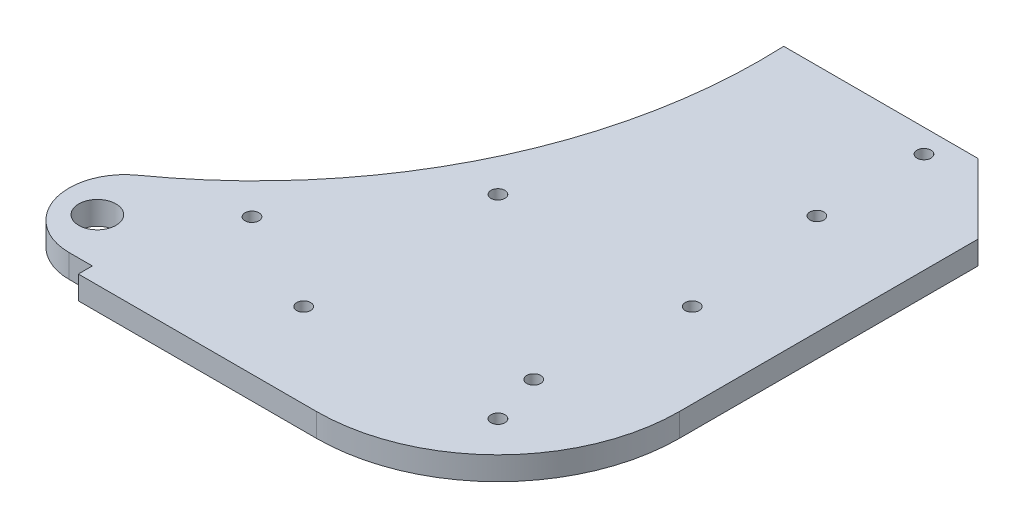
ISO-10303-21;
HEADER;
FILE_DESCRIPTION(('STEP AP214'),'2;1');
FILE_NAME('part.step','',(''),(''),'','','');
FILE_SCHEMA(('AUTOMOTIVE_DESIGN { 1 0 10303 214 1 1 1 1 }'));
ENDSEC;
DATA;
#1=APPLICATION_CONTEXT('core data for automotive mechanical design processes');
#2=APPLICATION_PROTOCOL_DEFINITION('international standard','automotive_design',2000,#1);
#3=PRODUCT_CONTEXT('',#1,'mechanical');
#4=PRODUCT('Part','Part','',(#3));
#5=PRODUCT_RELATED_PRODUCT_CATEGORY('part','',(#4));
#6=PRODUCT_DEFINITION_FORMATION('','',#4);
#7=PRODUCT_DEFINITION_CONTEXT('part definition',#1,'design');
#8=PRODUCT_DEFINITION('design','',#6,#7);
#9=PRODUCT_DEFINITION_SHAPE('','',#8);
#10=(LENGTH_UNIT() NAMED_UNIT(*) SI_UNIT(.MILLI.,.METRE.));
#11=(NAMED_UNIT(*) PLANE_ANGLE_UNIT() SI_UNIT($,.RADIAN.));
#12=(NAMED_UNIT(*) SI_UNIT($,.STERADIAN.) SOLID_ANGLE_UNIT());
#13=UNCERTAINTY_MEASURE_WITH_UNIT(LENGTH_MEASURE(1.E-05),#10,'distance_accuracy_value','');
#14=(GEOMETRIC_REPRESENTATION_CONTEXT(3) GLOBAL_UNCERTAINTY_ASSIGNED_CONTEXT((#13)) GLOBAL_UNIT_ASSIGNED_CONTEXT((#10,
#11,#12)) REPRESENTATION_CONTEXT('',''));
#15=CARTESIAN_POINT('',(0.,0.,0.));
#16=DIRECTION('',(0.,0.,1.));
#17=DIRECTION('',(1.,0.,0.));
#18=AXIS2_PLACEMENT_3D('',#15,#16,#17);
#19=CARTESIAN_POINT('',(0.,5.,0.));
#20=DIRECTION('',(0.,-1.,0.));
#21=DIRECTION('',(0.,0.,-1.));
#22=AXIS2_PLACEMENT_3D('',#19,#20,#21);
#23=CYLINDRICAL_SURFACE('',#22,38.9999999999999);
#24=CARTESIAN_POINT('',(0.,0.,0.));
#25=DIRECTION('',(0.,1.,0.));
#26=DIRECTION('',(0.,0.,1.));
#27=AXIS2_PLACEMENT_3D('',#24,#25,#26);
#28=CIRCLE('',#27,38.9999999999999);
#29=CARTESIAN_POINT('',(0.,0.,38.9999999999999));
#30=VERTEX_POINT('',#29);
#31=CARTESIAN_POINT('',(38.9999999999999,0.,0.));
#32=VERTEX_POINT('',#31);
#33=EDGE_CURVE('E134',#30,#32,#28,.T.);
#34=ORIENTED_EDGE('',*,*,#33,.T.);
#35=DIRECTION('',(0.,-1.,0.));
#36=VECTOR('',#35,1.);
#37=CARTESIAN_POINT('',(38.9999999999999,5.,0.));
#38=LINE('',#37,#36);
#39=CARTESIAN_POINT('',(38.9999999999999,5.,0.));
#40=VERTEX_POINT('',#39);
#41=EDGE_CURVE('E11',#40,#32,#38,.T.);
#42=ORIENTED_EDGE('',*,*,#41,.F.);
#43=CARTESIAN_POINT('',(0.,5.,0.));
#44=DIRECTION('',(0.,1.,0.));
#45=DIRECTION('',(0.,0.,1.));
#46=AXIS2_PLACEMENT_3D('',#43,#44,#45);
#47=CIRCLE('',#46,38.9999999999999);
#48=CARTESIAN_POINT('',(0.,5.,38.9999999999999));
#49=VERTEX_POINT('',#48);
#50=EDGE_CURVE('E151',#49,#40,#47,.T.);
#51=ORIENTED_EDGE('',*,*,#50,.F.);
#52=DIRECTION('',(0.,-1.,0.));
#53=VECTOR('',#52,1.);
#54=CARTESIAN_POINT('',(0.,5.,38.9999999999999));
#55=LINE('',#54,#53);
#56=EDGE_CURVE('E130',#49,#30,#55,.T.);
#57=ORIENTED_EDGE('',*,*,#56,.T.);
#58=EDGE_LOOP('',(#34,#42,#51,#57));
#59=FACE_BOUND('',#58,.T.);
#60=ADVANCED_FACE('F32',(#59),#23,.T.);
#61=CARTESIAN_POINT('',(38.9999999999999,5.,0.));
#62=DIRECTION('',(-1.,0.,0.));
#63=DIRECTION('',(0.,0.,1.));
#64=AXIS2_PLACEMENT_3D('',#61,#62,#63);
#65=PLANE('',#64);
#66=DIRECTION('',(0.,0.,-1.));
#67=VECTOR('',#66,1.);
#68=CARTESIAN_POINT('',(38.9999999999999,0.,0.));
#69=LINE('',#68,#67);
#70=CARTESIAN_POINT('',(38.9999999999999,0.,-64.082873122681));
#71=VERTEX_POINT('',#70);
#72=EDGE_CURVE('E137',#32,#71,#69,.T.);
#73=ORIENTED_EDGE('',*,*,#72,.T.);
#74=DIRECTION('',(0.,-1.,0.));
#75=VECTOR('',#74,1.);
#76=CARTESIAN_POINT('',(38.9999999999999,5.,-64.082873122681));
#77=LINE('',#76,#75);
#78=CARTESIAN_POINT('',(38.9999999999999,5.,-64.082873122681));
#79=VERTEX_POINT('',#78);
#80=EDGE_CURVE('E40',#79,#71,#77,.T.);
#81=ORIENTED_EDGE('',*,*,#80,.F.);
#82=DIRECTION('',(0.,0.,-1.));
#83=VECTOR('',#82,1.);
#84=CARTESIAN_POINT('',(38.9999999999999,5.,0.));
#85=LINE('',#84,#83);
#86=EDGE_CURVE('E94',#40,#79,#85,.T.);
#87=ORIENTED_EDGE('',*,*,#86,.F.);
#88=ORIENTED_EDGE('',*,*,#41,.T.);
#89=EDGE_LOOP('',(#73,#81,#87,#88));
#90=FACE_BOUND('',#89,.T.);
#91=ADVANCED_FACE('F288',(#90),#65,.F.);
#92=CARTESIAN_POINT('',(23.9999999999999,5.,-79.082873122681));
#93=DIRECTION('',(-0.707106781186548,0.,0.707106781186548));
#94=DIRECTION('',(0.707106781186548,0.,0.707106781186548));
#95=AXIS2_PLACEMENT_3D('',#92,#93,#94);
#96=PLANE('',#95);
#97=DIRECTION('',(-0.707106781186547,0.,-0.707106781186547));
#98=VECTOR('',#97,1.);
#99=CARTESIAN_POINT('',(23.9999999999999,0.,-79.082873122681));
#100=LINE('',#99,#98);
#101=CARTESIAN_POINT('',(23.9999999999999,0.,-79.082873122681));
#102=VERTEX_POINT('',#101);
#103=EDGE_CURVE('E140',#71,#102,#100,.T.);
#104=ORIENTED_EDGE('',*,*,#103,.T.);
#105=DIRECTION('',(0.,-1.,0.));
#106=VECTOR('',#105,1.);
#107=CARTESIAN_POINT('',(23.9999999999999,5.,-79.082873122681));
#108=LINE('',#107,#106);
#109=CARTESIAN_POINT('',(23.9999999999999,5.,-79.082873122681));
#110=VERTEX_POINT('',#109);
#111=EDGE_CURVE('E161',#110,#102,#108,.T.);
#112=ORIENTED_EDGE('',*,*,#111,.F.);
#113=DIRECTION('',(-0.707106781186547,0.,-0.707106781186547));
#114=VECTOR('',#113,1.);
#115=CARTESIAN_POINT('',(23.9999999999999,5.,-79.082873122681));
#116=LINE('',#115,#114);
#117=EDGE_CURVE('E169',#79,#110,#116,.T.);
#118=ORIENTED_EDGE('',*,*,#117,.F.);
#119=ORIENTED_EDGE('',*,*,#80,.T.);
#120=EDGE_LOOP('',(#104,#112,#118,#119));
#121=FACE_BOUND('',#120,.T.);
#122=ADVANCED_FACE('F167',(#121),#96,.F.);
#123=CARTESIAN_POINT('',(-17.7152686029994,5.,-79.082873122681));
#124=DIRECTION('',(0.,0.,1.));
#125=DIRECTION('',(1.,0.,0.));
#126=AXIS2_PLACEMENT_3D('',#123,#124,#125);
#127=PLANE('',#126);
#128=DIRECTION('',(-1.,0.,0.));
#129=VECTOR('',#128,1.);
#130=CARTESIAN_POINT('',(-17.7152686029994,0.,-79.082873122681));
#131=LINE('',#130,#129);
#132=CARTESIAN_POINT('',(-17.7152686029994,0.,-79.082873122681));
#133=VERTEX_POINT('',#132);
#134=EDGE_CURVE('E142',#102,#133,#131,.T.);
#135=ORIENTED_EDGE('',*,*,#134,.T.);
#136=DIRECTION('',(0.,-1.,0.));
#137=VECTOR('',#136,1.);
#138=CARTESIAN_POINT('',(-17.7152686029994,5.,-79.082873122681));
#139=LINE('',#138,#137);
#140=CARTESIAN_POINT('',(-17.7152686029994,5.,-79.082873122681));
#141=VERTEX_POINT('',#140);
#142=EDGE_CURVE('E158',#141,#133,#139,.T.);
#143=ORIENTED_EDGE('',*,*,#142,.F.);
#144=DIRECTION('',(-1.,0.,0.));
#145=VECTOR('',#144,1.);
#146=CARTESIAN_POINT('',(-17.7152686029994,5.,-79.082873122681));
#147=LINE('',#146,#145);
#148=EDGE_CURVE('E185',#110,#141,#147,.T.);
#149=ORIENTED_EDGE('',*,*,#148,.F.);
#150=ORIENTED_EDGE('',*,*,#111,.T.);
#151=EDGE_LOOP('',(#135,#143,#149,#150));
#152=FACE_BOUND('',#151,.T.);
#153=ADVANCED_FACE('F178',(#152),#127,.F.);
#154=CARTESIAN_POINT('',(-126.1,5.,-74.0828731226806));
#155=DIRECTION('',(0.,-1.,0.));
#156=DIRECTION('',(0.,0.,-1.));
#157=AXIS2_PLACEMENT_3D('',#154,#155,#156);
#158=CYLINDRICAL_SURFACE('',#157,108.5);
#159=CARTESIAN_POINT('',(-126.1,0.,-74.0828731226806));
#160=DIRECTION('',(0.,-1.,0.));
#161=DIRECTION('',(0.,0.,1.));
#162=AXIS2_PLACEMENT_3D('',#159,#160,#161);
#163=CIRCLE('',#162,108.5);
#164=CARTESIAN_POINT('',(-63.0709543568465,0.,14.2324109753353));
#165=VERTEX_POINT('',#164);
#166=EDGE_CURVE('E144',#133,#165,#163,.T.);
#167=ORIENTED_EDGE('',*,*,#166,.T.);
#168=DIRECTION('',(0.,-1.,0.));
#169=VECTOR('',#168,1.);
#170=CARTESIAN_POINT('',(-63.0709543568465,5.,14.2324109753353));
#171=LINE('',#170,#169);
#172=CARTESIAN_POINT('',(-63.0709543568465,5.,14.2324109753353));
#173=VERTEX_POINT('',#172);
#174=EDGE_CURVE('E155',#173,#165,#171,.T.);
#175=ORIENTED_EDGE('',*,*,#174,.F.);
#176=CARTESIAN_POINT('',(-126.1,5.,-74.0828731226806));
#177=DIRECTION('',(0.,-1.,0.));
#178=DIRECTION('',(0.,0.,1.));
#179=AXIS2_PLACEMENT_3D('',#176,#177,#178);
#180=CIRCLE('',#179,108.5);
#181=EDGE_CURVE('E184',#141,#173,#180,.T.);
#182=ORIENTED_EDGE('',*,*,#181,.F.);
#183=ORIENTED_EDGE('',*,*,#142,.T.);
#184=EDGE_LOOP('',(#167,#175,#182,#183));
#185=FACE_BOUND('',#184,.T.);
#186=ADVANCED_FACE('F182',(#185),#158,.F.);
#187=CARTESIAN_POINT('',(-56.1000000000001,5.,24.0000000000006));
#188=DIRECTION('',(0.,-1.,0.));
#189=DIRECTION('',(0.,0.,-1.));
#190=AXIS2_PLACEMENT_3D('',#187,#188,#189);
#191=CYLINDRICAL_SURFACE('',#190,12.);
#192=CARTESIAN_POINT('',(-56.1000000000001,0.,24.0000000000006));
#193=DIRECTION('',(0.,1.,0.));
#194=DIRECTION('',(0.,0.,1.));
#195=AXIS2_PLACEMENT_3D('',#192,#193,#194);
#196=CIRCLE('',#195,12.);
#197=CARTESIAN_POINT('',(-56.1000000000001,0.,36.0000000000006));
#198=VERTEX_POINT('',#197);
#199=EDGE_CURVE('E146',#165,#198,#196,.T.);
#200=ORIENTED_EDGE('',*,*,#199,.T.);
#201=DIRECTION('',(0.,-1.,0.));
#202=VECTOR('',#201,1.);
#203=CARTESIAN_POINT('',(-56.1000000000001,5.,36.0000000000006));
#204=LINE('',#203,#202);
#205=CARTESIAN_POINT('',(-56.1000000000001,5.,36.0000000000006));
#206=VERTEX_POINT('',#205);
#207=EDGE_CURVE('E125',#206,#198,#204,.T.);
#208=ORIENTED_EDGE('',*,*,#207,.F.);
#209=CARTESIAN_POINT('',(-56.1000000000001,5.,24.0000000000006));
#210=DIRECTION('',(0.,1.,0.));
#211=DIRECTION('',(0.,0.,1.));
#212=AXIS2_PLACEMENT_3D('',#209,#210,#211);
#213=CIRCLE('',#212,12.);
#214=EDGE_CURVE('E116',#173,#206,#213,.T.);
#215=ORIENTED_EDGE('',*,*,#214,.F.);
#216=ORIENTED_EDGE('',*,*,#174,.T.);
#217=EDGE_LOOP('',(#200,#208,#215,#216));
#218=FACE_BOUND('',#217,.T.);
#219=ADVANCED_FACE('F296',(#218),#191,.T.);
#220=CARTESIAN_POINT('',(-56.1000000000001,5.,36.0000000000006));
#221=DIRECTION('',(0.,0.,-1.));
#222=DIRECTION('',(-1.,0.,0.));
#223=AXIS2_PLACEMENT_3D('',#220,#221,#222);
#224=PLANE('',#223);
#225=DIRECTION('',(1.,0.,0.));
#226=VECTOR('',#225,1.);
#227=CARTESIAN_POINT('',(-56.1000000000001,0.,36.0000000000006));
#228=LINE('',#227,#226);
#229=CARTESIAN_POINT('',(-51.1000000000001,0.,36.0000000000006));
#230=VERTEX_POINT('',#229);
#231=EDGE_CURVE('E124',#198,#230,#228,.T.);
#232=ORIENTED_EDGE('',*,*,#231,.T.);
#233=DIRECTION('',(0.,-1.,0.));
#234=VECTOR('',#233,1.);
#235=CARTESIAN_POINT('',(-51.1000000000001,5.,36.0000000000006));
#236=LINE('',#235,#234);
#237=CARTESIAN_POINT('',(-51.1000000000001,5.,36.0000000000006));
#238=VERTEX_POINT('',#237);
#239=EDGE_CURVE('E121',#238,#230,#236,.T.);
#240=ORIENTED_EDGE('',*,*,#239,.F.);
#241=DIRECTION('',(1.,0.,0.));
#242=VECTOR('',#241,1.);
#243=CARTESIAN_POINT('',(-56.1000000000001,5.,36.0000000000006));
#244=LINE('',#243,#242);
#245=EDGE_CURVE('E110',#206,#238,#244,.T.);
#246=ORIENTED_EDGE('',*,*,#245,.F.);
#247=ORIENTED_EDGE('',*,*,#207,.T.);
#248=EDGE_LOOP('',(#232,#240,#246,#247));
#249=FACE_BOUND('',#248,.T.);
#250=ADVANCED_FACE('F122',(#249),#224,.F.);
#251=CARTESIAN_POINT('',(-51.1000000000001,5.,36.0000000000006));
#252=DIRECTION('',(1.,0.,0.));
#253=DIRECTION('',(0.,0.,-1.));
#254=AXIS2_PLACEMENT_3D('',#251,#252,#253);
#255=PLANE('',#254);
#256=DIRECTION('',(0.,0.,1.));
#257=VECTOR('',#256,1.);
#258=CARTESIAN_POINT('',(-51.1000000000001,0.,36.0000000000006));
#259=LINE('',#258,#257);
#260=CARTESIAN_POINT('',(-51.1000000000001,0.,39.0000000000006));
#261=VERTEX_POINT('',#260);
#262=EDGE_CURVE('E80',#230,#261,#259,.T.);
#263=ORIENTED_EDGE('',*,*,#262,.T.);
#264=DIRECTION('',(0.,-1.,0.));
#265=VECTOR('',#264,1.);
#266=CARTESIAN_POINT('',(-51.1000000000001,5.,39.0000000000006));
#267=LINE('',#266,#265);
#268=CARTESIAN_POINT('',(-51.1000000000001,5.,39.0000000000006));
#269=VERTEX_POINT('',#268);
#270=EDGE_CURVE('E126',#269,#261,#267,.T.);
#271=ORIENTED_EDGE('',*,*,#270,.F.);
#272=DIRECTION('',(0.,0.,1.));
#273=VECTOR('',#272,1.);
#274=CARTESIAN_POINT('',(-51.1000000000001,5.,36.0000000000006));
#275=LINE('',#274,#273);
#276=EDGE_CURVE('E114',#238,#269,#275,.T.);
#277=ORIENTED_EDGE('',*,*,#276,.F.);
#278=ORIENTED_EDGE('',*,*,#239,.T.);
#279=EDGE_LOOP('',(#263,#271,#277,#278));
#280=FACE_BOUND('',#279,.T.);
#281=ADVANCED_FACE('F128',(#280),#255,.F.);
#282=CARTESIAN_POINT('',(-51.1000000000001,5.,39.0000000000006));
#283=DIRECTION('',(0.,0.,-1.));
#284=DIRECTION('',(-1.,0.,0.));
#285=AXIS2_PLACEMENT_3D('',#282,#283,#284);
#286=PLANE('',#285);
#287=DIRECTION('',(1.,0.,0.));
#288=VECTOR('',#287,1.);
#289=CARTESIAN_POINT('',(-51.1000000000001,0.,39.0000000000006));
#290=LINE('',#289,#288);
#291=EDGE_CURVE('E86',#261,#30,#290,.T.);
#292=ORIENTED_EDGE('',*,*,#291,.T.);
#293=ORIENTED_EDGE('',*,*,#56,.F.);
#294=DIRECTION('',(1.,0.,0.));
#295=VECTOR('',#294,1.);
#296=CARTESIAN_POINT('',(-51.1000000000001,5.,39.0000000000006));
#297=LINE('',#296,#295);
#298=EDGE_CURVE('E48',#269,#49,#297,.T.);
#299=ORIENTED_EDGE('',*,*,#298,.F.);
#300=ORIENTED_EDGE('',*,*,#270,.T.);
#301=EDGE_LOOP('',(#292,#293,#299,#300));
#302=FACE_BOUND('',#301,.T.);
#303=ADVANCED_FACE('F257',(#302),#286,.F.);
#304=CARTESIAN_POINT('',(0.,5.,0.));
#305=DIRECTION('',(0.,1.,0.));
#306=DIRECTION('',(0.,0.,1.));
#307=AXIS2_PLACEMENT_3D('',#304,#305,#306);
#308=PLANE('',#307);
#309=CARTESIAN_POINT('',(-60.0999999999482,5.,25.9171268773103));
#310=DIRECTION('',(0.,1.,0.));
#311=DIRECTION('',(0.,0.,1.));
#312=AXIS2_PLACEMENT_3D('',#309,#310,#311);
#313=CIRCLE('',#312,4.00000000000001);
#314=CARTESIAN_POINT('',(-60.0999999999482,5.,29.9171268773103));
#315=VERTEX_POINT('',#314);
#316=EDGE_CURVE('E240',#315,#315,#313,.T.);
#317=ORIENTED_EDGE('',*,*,#316,.F.);
#318=EDGE_LOOP('',(#317));
#319=FACE_BOUND('',#318,.T.);
#320=CARTESIAN_POINT('',(-43.1000000000001,5.,9.71712687731938));
#321=DIRECTION('',(0.,1.,0.));
#322=DIRECTION('',(0.,0.,1.));
#323=AXIS2_PLACEMENT_3D('',#320,#321,#322);
#324=CIRCLE('',#323,1.5);
#325=CARTESIAN_POINT('',(-43.1000000000001,5.,11.2171268773194));
#326=VERTEX_POINT('',#325);
#327=EDGE_CURVE('E234',#326,#326,#324,.T.);
#328=ORIENTED_EDGE('',*,*,#327,.F.);
#329=EDGE_LOOP('',(#328));
#330=FACE_BOUND('',#329,.T.);
#331=CARTESIAN_POINT('',(17.3999999999999,5.,-51.0828731226806));
#332=DIRECTION('',(0.,1.,0.));
#333=DIRECTION('',(0.,0.,1.));
#334=AXIS2_PLACEMENT_3D('',#331,#332,#333);
#335=CIRCLE('',#334,1.5);
#336=CARTESIAN_POINT('',(17.3999999999999,5.,-49.5828731226806));
#337=VERTEX_POINT('',#336);
#338=EDGE_CURVE('E228',#337,#337,#335,.T.);
#339=ORIENTED_EDGE('',*,*,#338,.F.);
#340=EDGE_LOOP('',(#339));
#341=FACE_BOUND('',#340,.T.);
#342=CARTESIAN_POINT('',(17.3999999999999,5.,9.71712687731938));
#343=DIRECTION('',(0.,-1.,0.));
#344=DIRECTION('',(0.,0.,-1.));
#345=AXIS2_PLACEMENT_3D('',#342,#343,#344);
#346=CIRCLE('',#345,1.50000000000001);
#347=CARTESIAN_POINT('',(17.3999999999999,5.,8.21712687731937));
#348=VERTEX_POINT('',#347);
#349=EDGE_CURVE('E219',#348,#348,#346,.T.);
#350=ORIENTED_EDGE('',*,*,#349,.T.);
#351=EDGE_LOOP('',(#350));
#352=FACE_BOUND('',#351,.T.);
#353=CARTESIAN_POINT('',(17.3999999999999,5.,-74.0828731226809));
#354=DIRECTION('',(0.,-1.,0.));
#355=DIRECTION('',(0.,0.,-1.));
#356=AXIS2_PLACEMENT_3D('',#353,#354,#355);
#357=CIRCLE('',#356,1.5);
#358=CARTESIAN_POINT('',(17.3999999999999,5.,-75.5828731226809));
#359=VERTEX_POINT('',#358);
#360=EDGE_CURVE('E213',#359,#359,#357,.T.);
#361=ORIENTED_EDGE('',*,*,#360,.T.);
#362=EDGE_LOOP('',(#361));
#363=FACE_BOUND('',#362,.T.);
#364=CARTESIAN_POINT('',(-20.859650045,5.,20.859650045));
#365=DIRECTION('',(0.,-1.,0.));
#366=DIRECTION('',(0.,0.,-1.));
#367=AXIS2_PLACEMENT_3D('',#364,#365,#366);
#368=CIRCLE('',#367,1.5);
#369=CARTESIAN_POINT('',(-20.859650045,5.,19.359650045));
#370=VERTEX_POINT('',#369);
#371=EDGE_CURVE('E207',#370,#370,#368,.T.);
#372=ORIENTED_EDGE('',*,*,#371,.T.);
#373=EDGE_LOOP('',(#372));
#374=FACE_BOUND('',#373,.T.);
#375=CARTESIAN_POINT('',(-20.859650045,5.,-20.859650045));
#376=DIRECTION('',(0.,-1.,0.));
#377=DIRECTION('',(0.,0.,-1.));
#378=AXIS2_PLACEMENT_3D('',#375,#376,#377);
#379=CIRCLE('',#378,1.5);
#380=CARTESIAN_POINT('',(-20.859650045,5.,-22.359650045));
#381=VERTEX_POINT('',#380);
#382=EDGE_CURVE('E201',#381,#381,#379,.T.);
#383=ORIENTED_EDGE('',*,*,#382,.T.);
#384=EDGE_LOOP('',(#383));
#385=FACE_BOUND('',#384,.T.);
#386=CARTESIAN_POINT('',(20.859650045,5.,-20.859650045));
#387=DIRECTION('',(0.,-1.,0.));
#388=DIRECTION('',(0.,0.,-1.));
#389=AXIS2_PLACEMENT_3D('',#386,#387,#388);
#390=CIRCLE('',#389,1.5);
#391=CARTESIAN_POINT('',(20.859650045,5.,-22.359650045));
#392=VERTEX_POINT('',#391);
#393=EDGE_CURVE('E195',#392,#392,#390,.T.);
#394=ORIENTED_EDGE('',*,*,#393,.T.);
#395=EDGE_LOOP('',(#394));
#396=FACE_BOUND('',#395,.T.);
#397=CARTESIAN_POINT('',(20.859650045,5.,20.859650045));
#398=DIRECTION('',(0.,-1.,0.));
#399=DIRECTION('',(0.,0.,-1.));
#400=AXIS2_PLACEMENT_3D('',#397,#398,#399);
#401=CIRCLE('',#400,1.5);
#402=CARTESIAN_POINT('',(20.859650045,5.,19.359650045));
#403=VERTEX_POINT('',#402);
#404=EDGE_CURVE('E138',#403,#403,#401,.T.);
#405=ORIENTED_EDGE('',*,*,#404,.T.);
#406=EDGE_LOOP('',(#405));
#407=FACE_BOUND('',#406,.T.);
#408=ORIENTED_EDGE('',*,*,#50,.T.);
#409=ORIENTED_EDGE('',*,*,#86,.T.);
#410=ORIENTED_EDGE('',*,*,#117,.T.);
#411=ORIENTED_EDGE('',*,*,#148,.T.);
#412=ORIENTED_EDGE('',*,*,#181,.T.);
#413=ORIENTED_EDGE('',*,*,#214,.T.);
#414=ORIENTED_EDGE('',*,*,#245,.T.);
#415=ORIENTED_EDGE('',*,*,#276,.T.);
#416=ORIENTED_EDGE('',*,*,#298,.T.);
#417=EDGE_LOOP('',(#408,#409,#410,#411,#412,#413,#414,#415,#416));
#418=FACE_BOUND('',#417,.T.);
#419=ADVANCED_FACE('F112',(#319,#330,#341,#352,#363,#374,#385,#396,#407,#418),#308,.T.);
#420=CARTESIAN_POINT('',(0.,0.,0.));
#421=DIRECTION('',(0.,1.,0.));
#422=DIRECTION('',(0.,0.,1.));
#423=AXIS2_PLACEMENT_3D('',#420,#421,#422);
#424=PLANE('',#423);
#425=CARTESIAN_POINT('',(-60.0999999999482,0.,25.9171268773103));
#426=DIRECTION('',(0.,1.,0.));
#427=DIRECTION('',(0.,0.,1.));
#428=AXIS2_PLACEMENT_3D('',#425,#426,#427);
#429=CIRCLE('',#428,4.00000000000001);
#430=CARTESIAN_POINT('',(-60.0999999999482,0.,29.9171268773103));
#431=VERTEX_POINT('',#430);
#432=EDGE_CURVE('E237',#431,#431,#429,.T.);
#433=ORIENTED_EDGE('',*,*,#432,.T.);
#434=EDGE_LOOP('',(#433));
#435=FACE_BOUND('',#434,.T.);
#436=CARTESIAN_POINT('',(-43.1000000000001,0.,9.71712687731938));
#437=DIRECTION('',(0.,1.,0.));
#438=DIRECTION('',(0.,0.,1.));
#439=AXIS2_PLACEMENT_3D('',#436,#437,#438);
#440=CIRCLE('',#439,1.5);
#441=CARTESIAN_POINT('',(-43.1000000000001,0.,11.2171268773194));
#442=VERTEX_POINT('',#441);
#443=EDGE_CURVE('E231',#442,#442,#440,.T.);
#444=ORIENTED_EDGE('',*,*,#443,.T.);
#445=EDGE_LOOP('',(#444));
#446=FACE_BOUND('',#445,.T.);
#447=CARTESIAN_POINT('',(17.3999999999999,0.,-51.0828731226806));
#448=DIRECTION('',(0.,1.,0.));
#449=DIRECTION('',(0.,0.,1.));
#450=AXIS2_PLACEMENT_3D('',#447,#448,#449);
#451=CIRCLE('',#450,1.5);
#452=CARTESIAN_POINT('',(17.3999999999999,0.,-49.5828731226806));
#453=VERTEX_POINT('',#452);
#454=EDGE_CURVE('E225',#453,#453,#451,.T.);
#455=ORIENTED_EDGE('',*,*,#454,.T.);
#456=EDGE_LOOP('',(#455));
#457=FACE_BOUND('',#456,.T.);
#458=CARTESIAN_POINT('',(17.3999999999999,0.,9.71712687731938));
#459=DIRECTION('',(0.,-1.,0.));
#460=DIRECTION('',(0.,0.,-1.));
#461=AXIS2_PLACEMENT_3D('',#458,#459,#460);
#462=CIRCLE('',#461,1.50000000000001);
#463=CARTESIAN_POINT('',(17.3999999999999,0.,8.21712687731937));
#464=VERTEX_POINT('',#463);
#465=EDGE_CURVE('E222',#464,#464,#462,.T.);
#466=ORIENTED_EDGE('',*,*,#465,.F.);
#467=EDGE_LOOP('',(#466));
#468=FACE_BOUND('',#467,.T.);
#469=CARTESIAN_POINT('',(17.3999999999999,0.,-74.0828731226809));
#470=DIRECTION('',(0.,-1.,0.));
#471=DIRECTION('',(0.,0.,-1.));
#472=AXIS2_PLACEMENT_3D('',#469,#470,#471);
#473=CIRCLE('',#472,1.5);
#474=CARTESIAN_POINT('',(17.3999999999999,0.,-75.5828731226809));
#475=VERTEX_POINT('',#474);
#476=EDGE_CURVE('E216',#475,#475,#473,.T.);
#477=ORIENTED_EDGE('',*,*,#476,.F.);
#478=EDGE_LOOP('',(#477));
#479=FACE_BOUND('',#478,.T.);
#480=CARTESIAN_POINT('',(-20.859650045,0.,20.859650045));
#481=DIRECTION('',(0.,-1.,0.));
#482=DIRECTION('',(0.,0.,-1.));
#483=AXIS2_PLACEMENT_3D('',#480,#481,#482);
#484=CIRCLE('',#483,1.5);
#485=CARTESIAN_POINT('',(-20.859650045,0.,19.359650045));
#486=VERTEX_POINT('',#485);
#487=EDGE_CURVE('E210',#486,#486,#484,.T.);
#488=ORIENTED_EDGE('',*,*,#487,.F.);
#489=EDGE_LOOP('',(#488));
#490=FACE_BOUND('',#489,.T.);
#491=CARTESIAN_POINT('',(-20.859650045,0.,-20.859650045));
#492=DIRECTION('',(0.,-1.,0.));
#493=DIRECTION('',(0.,0.,-1.));
#494=AXIS2_PLACEMENT_3D('',#491,#492,#493);
#495=CIRCLE('',#494,1.5);
#496=CARTESIAN_POINT('',(-20.859650045,0.,-22.359650045));
#497=VERTEX_POINT('',#496);
#498=EDGE_CURVE('E204',#497,#497,#495,.T.);
#499=ORIENTED_EDGE('',*,*,#498,.F.);
#500=EDGE_LOOP('',(#499));
#501=FACE_BOUND('',#500,.T.);
#502=CARTESIAN_POINT('',(20.859650045,0.,-20.859650045));
#503=DIRECTION('',(0.,-1.,0.));
#504=DIRECTION('',(0.,0.,-1.));
#505=AXIS2_PLACEMENT_3D('',#502,#503,#504);
#506=CIRCLE('',#505,1.5);
#507=CARTESIAN_POINT('',(20.859650045,0.,-22.359650045));
#508=VERTEX_POINT('',#507);
#509=EDGE_CURVE('E198',#508,#508,#506,.T.);
#510=ORIENTED_EDGE('',*,*,#509,.F.);
#511=EDGE_LOOP('',(#510));
#512=FACE_BOUND('',#511,.T.);
#513=CARTESIAN_POINT('',(20.859650045,0.,20.859650045));
#514=DIRECTION('',(0.,-1.,0.));
#515=DIRECTION('',(0.,0.,-1.));
#516=AXIS2_PLACEMENT_3D('',#513,#514,#515);
#517=CIRCLE('',#516,1.5);
#518=CARTESIAN_POINT('',(20.859650045,0.,19.359650045));
#519=VERTEX_POINT('',#518);
#520=EDGE_CURVE('E192',#519,#519,#517,.T.);
#521=ORIENTED_EDGE('',*,*,#520,.F.);
#522=EDGE_LOOP('',(#521));
#523=FACE_BOUND('',#522,.T.);
#524=ORIENTED_EDGE('',*,*,#33,.F.);
#525=ORIENTED_EDGE('',*,*,#291,.F.);
#526=ORIENTED_EDGE('',*,*,#262,.F.);
#527=ORIENTED_EDGE('',*,*,#231,.F.);
#528=ORIENTED_EDGE('',*,*,#199,.F.);
#529=ORIENTED_EDGE('',*,*,#166,.F.);
#530=ORIENTED_EDGE('',*,*,#134,.F.);
#531=ORIENTED_EDGE('',*,*,#103,.F.);
#532=ORIENTED_EDGE('',*,*,#72,.F.);
#533=EDGE_LOOP('',(#524,#525,#526,#527,#528,#529,#530,#531,#532));
#534=FACE_BOUND('',#533,.T.);
#535=ADVANCED_FACE('F173',(#435,#446,#457,#468,#479,#490,#501,#512,#523,#534),#424,.F.);
#536=CARTESIAN_POINT('',(20.859650045,5.,20.859650045));
#537=DIRECTION('',(0.,-1.,0.));
#538=DIRECTION('',(0.,0.,-1.));
#539=AXIS2_PLACEMENT_3D('',#536,#537,#538);
#540=CYLINDRICAL_SURFACE('',#539,1.5);
#541=ORIENTED_EDGE('',*,*,#404,.F.);
#542=EDGE_LOOP('',(#541));
#543=FACE_BOUND('',#542,.T.);
#544=ORIENTED_EDGE('',*,*,#520,.T.);
#545=EDGE_LOOP('',(#544));
#546=FACE_BOUND('',#545,.T.);
#547=ADVANCED_FACE('F275',(#543,#546),#540,.F.);
#548=CARTESIAN_POINT('',(20.859650045,5.,-20.859650045));
#549=DIRECTION('',(0.,-1.,0.));
#550=DIRECTION('',(0.,0.,-1.));
#551=AXIS2_PLACEMENT_3D('',#548,#549,#550);
#552=CYLINDRICAL_SURFACE('',#551,1.5);
#553=ORIENTED_EDGE('',*,*,#393,.F.);
#554=EDGE_LOOP('',(#553));
#555=FACE_BOUND('',#554,.T.);
#556=ORIENTED_EDGE('',*,*,#509,.T.);
#557=EDGE_LOOP('',(#556));
#558=FACE_BOUND('',#557,.T.);
#559=ADVANCED_FACE('F278',(#555,#558),#552,.F.);
#560=CARTESIAN_POINT('',(-20.859650045,5.,-20.859650045));
#561=DIRECTION('',(0.,-1.,0.));
#562=DIRECTION('',(0.,0.,-1.));
#563=AXIS2_PLACEMENT_3D('',#560,#561,#562);
#564=CYLINDRICAL_SURFACE('',#563,1.5);
#565=ORIENTED_EDGE('',*,*,#382,.F.);
#566=EDGE_LOOP('',(#565));
#567=FACE_BOUND('',#566,.T.);
#568=ORIENTED_EDGE('',*,*,#498,.T.);
#569=EDGE_LOOP('',(#568));
#570=FACE_BOUND('',#569,.T.);
#571=ADVANCED_FACE('F363',(#567,#570),#564,.F.);
#572=CARTESIAN_POINT('',(-20.859650045,5.,20.859650045));
#573=DIRECTION('',(0.,-1.,0.));
#574=DIRECTION('',(0.,0.,-1.));
#575=AXIS2_PLACEMENT_3D('',#572,#573,#574);
#576=CYLINDRICAL_SURFACE('',#575,1.5);
#577=ORIENTED_EDGE('',*,*,#371,.F.);
#578=EDGE_LOOP('',(#577));
#579=FACE_BOUND('',#578,.T.);
#580=ORIENTED_EDGE('',*,*,#487,.T.);
#581=EDGE_LOOP('',(#580));
#582=FACE_BOUND('',#581,.T.);
#583=ADVANCED_FACE('F373',(#579,#582),#576,.F.);
#584=CARTESIAN_POINT('',(17.3999999999999,5.,-74.0828731226809));
#585=DIRECTION('',(0.,-1.,0.));
#586=DIRECTION('',(0.,0.,-1.));
#587=AXIS2_PLACEMENT_3D('',#584,#585,#586);
#588=CYLINDRICAL_SURFACE('',#587,1.5);
#589=ORIENTED_EDGE('',*,*,#360,.F.);
#590=EDGE_LOOP('',(#589));
#591=FACE_BOUND('',#590,.T.);
#592=ORIENTED_EDGE('',*,*,#476,.T.);
#593=EDGE_LOOP('',(#592));
#594=FACE_BOUND('',#593,.T.);
#595=ADVANCED_FACE('F383',(#591,#594),#588,.F.);
#596=CARTESIAN_POINT('',(17.3999999999999,5.,9.71712687731938));
#597=DIRECTION('',(0.,-1.,0.));
#598=DIRECTION('',(0.,0.,-1.));
#599=AXIS2_PLACEMENT_3D('',#596,#597,#598);
#600=CYLINDRICAL_SURFACE('',#599,1.50000000000001);
#601=ORIENTED_EDGE('',*,*,#349,.F.);
#602=EDGE_LOOP('',(#601));
#603=FACE_BOUND('',#602,.T.);
#604=ORIENTED_EDGE('',*,*,#465,.T.);
#605=EDGE_LOOP('',(#604));
#606=FACE_BOUND('',#605,.T.);
#607=ADVANCED_FACE('F393',(#603,#606),#600,.F.);
#608=CARTESIAN_POINT('',(17.3999999999999,0.,-51.0828731226806));
#609=DIRECTION('',(0.,1.,0.));
#610=DIRECTION('',(0.,0.,1.));
#611=AXIS2_PLACEMENT_3D('',#608,#609,#610);
#612=CYLINDRICAL_SURFACE('',#611,1.5);
#613=ORIENTED_EDGE('',*,*,#454,.F.);
#614=EDGE_LOOP('',(#613));
#615=FACE_BOUND('',#614,.T.);
#616=ORIENTED_EDGE('',*,*,#338,.T.);
#617=EDGE_LOOP('',(#616));
#618=FACE_BOUND('',#617,.T.);
#619=ADVANCED_FACE('F403',(#615,#618),#612,.F.);
#620=CARTESIAN_POINT('',(-43.1000000000001,0.,9.71712687731938));
#621=DIRECTION('',(0.,1.,0.));
#622=DIRECTION('',(0.,0.,1.));
#623=AXIS2_PLACEMENT_3D('',#620,#621,#622);
#624=CYLINDRICAL_SURFACE('',#623,1.5);
#625=ORIENTED_EDGE('',*,*,#443,.F.);
#626=EDGE_LOOP('',(#625));
#627=FACE_BOUND('',#626,.T.);
#628=ORIENTED_EDGE('',*,*,#327,.T.);
#629=EDGE_LOOP('',(#628));
#630=FACE_BOUND('',#629,.T.);
#631=ADVANCED_FACE('F251',(#627,#630),#624,.F.);
#632=CARTESIAN_POINT('',(-60.0999999999482,0.,25.9171268773103));
#633=DIRECTION('',(0.,1.,0.));
#634=DIRECTION('',(0.,0.,1.));
#635=AXIS2_PLACEMENT_3D('',#632,#633,#634);
#636=CYLINDRICAL_SURFACE('',#635,4.00000000000001);
#637=ORIENTED_EDGE('',*,*,#432,.F.);
#638=EDGE_LOOP('',(#637));
#639=FACE_BOUND('',#638,.T.);
#640=ORIENTED_EDGE('',*,*,#316,.T.);
#641=EDGE_LOOP('',(#640));
#642=FACE_BOUND('',#641,.T.);
#643=ADVANCED_FACE('F248',(#639,#642),#636,.F.);
#644=CLOSED_SHELL('',(#60,#91,#122,#153,#186,#219,#250,#281,#303,#419,#535,#547,#559,#571,#583,
#595,#607,#619,#631,#643));
#645=MANIFOLD_SOLID_BREP('B2',#644);
#646=ADVANCED_BREP_SHAPE_REPRESENTATION('',(#18,#645),#14);
#647=SHAPE_DEFINITION_REPRESENTATION(#9,#646);
ENDSEC;
END-ISO-10303-21;
